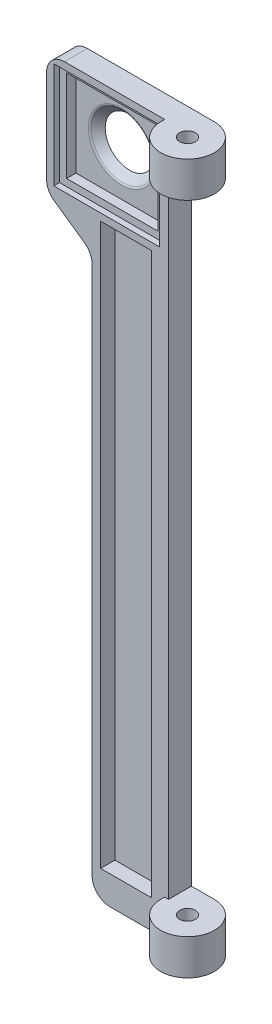
ISO-10303-21;
HEADER;
FILE_DESCRIPTION(('STEP AP214'),'2;1');
FILE_NAME('part.step','',(''),(''),'','','');
FILE_SCHEMA(('AUTOMOTIVE_DESIGN { 1 0 10303 214 1 1 1 1 }'));
ENDSEC;
DATA;
#1=APPLICATION_CONTEXT('core data for automotive mechanical design processes');
#2=APPLICATION_PROTOCOL_DEFINITION('international standard','automotive_design',2000,#1);
#3=PRODUCT_CONTEXT('',#1,'mechanical');
#4=PRODUCT('Part','Part','',(#3));
#5=PRODUCT_RELATED_PRODUCT_CATEGORY('part','',(#4));
#6=PRODUCT_DEFINITION_FORMATION('','',#4);
#7=PRODUCT_DEFINITION_CONTEXT('part definition',#1,'design');
#8=PRODUCT_DEFINITION('design','',#6,#7);
#9=PRODUCT_DEFINITION_SHAPE('','',#8);
#10=(LENGTH_UNIT() NAMED_UNIT(*) SI_UNIT(.MILLI.,.METRE.));
#11=(NAMED_UNIT(*) PLANE_ANGLE_UNIT() SI_UNIT($,.RADIAN.));
#12=(NAMED_UNIT(*) SI_UNIT($,.STERADIAN.) SOLID_ANGLE_UNIT());
#13=UNCERTAINTY_MEASURE_WITH_UNIT(LENGTH_MEASURE(1.E-05),#10,'distance_accuracy_value','');
#14=(GEOMETRIC_REPRESENTATION_CONTEXT(3) GLOBAL_UNCERTAINTY_ASSIGNED_CONTEXT((#13)) GLOBAL_UNIT_ASSIGNED_CONTEXT((#10,
#11,#12)) REPRESENTATION_CONTEXT('',''));
#15=CARTESIAN_POINT('',(0.,0.,0.));
#16=DIRECTION('',(0.,0.,1.));
#17=DIRECTION('',(1.,0.,0.));
#18=AXIS2_PLACEMENT_3D('',#15,#16,#17);
#19=CARTESIAN_POINT('',(0.,0.,4.064));
#20=DIRECTION('',(0.,0.,-1.));
#21=DIRECTION('',(-1.,0.,0.));
#22=AXIS2_PLACEMENT_3D('',#19,#20,#21);
#23=PLANE('',#22);
#24=DIRECTION('',(-1.,0.,0.));
#25=VECTOR('',#24,1.);
#26=CARTESIAN_POINT('',(-6.80720000000004,124.714,4.064));
#27=LINE('',#26,#25);
#28=CARTESIAN_POINT('',(11.9888,124.714,4.064));
#29=VERTEX_POINT('',#28);
#30=CARTESIAN_POINT('',(-6.80720000000004,124.714,4.064));
#31=VERTEX_POINT('',#30);
#32=EDGE_CURVE('E318',#29,#31,#27,.T.);
#33=ORIENTED_EDGE('',*,*,#32,.F.);
#34=DIRECTION('',(0.,1.,0.));
#35=VECTOR('',#34,1.);
#36=CARTESIAN_POINT('',(11.9888,124.714,4.064));
#37=LINE('',#36,#35);
#38=CARTESIAN_POINT('',(11.9888,105.918,4.064));
#39=VERTEX_POINT('',#38);
#40=EDGE_CURVE('E316',#39,#29,#37,.T.);
#41=ORIENTED_EDGE('',*,*,#40,.F.);
#42=DIRECTION('',(1.,0.,0.));
#43=VECTOR('',#42,1.);
#44=CARTESIAN_POINT('',(-6.80720000000004,105.918,4.064));
#45=LINE('',#44,#43);
#46=CARTESIAN_POINT('',(-6.80720000000004,105.918,4.064));
#47=VERTEX_POINT('',#46);
#48=EDGE_CURVE('E306',#47,#39,#45,.T.);
#49=ORIENTED_EDGE('',*,*,#48,.F.);
#50=DIRECTION('',(0.,-1.,0.));
#51=VECTOR('',#50,1.);
#52=CARTESIAN_POINT('',(-6.80720000000004,124.714,4.064));
#53=LINE('',#52,#51);
#54=EDGE_CURVE('E321',#31,#47,#53,.T.);
#55=ORIENTED_EDGE('',*,*,#54,.F.);
#56=EDGE_LOOP('',(#33,#41,#49,#55));
#57=FACE_BOUND('',#56,.T.);
#58=DIRECTION('',(1.,0.,0.));
#59=VECTOR('',#58,1.);
#60=CARTESIAN_POINT('',(15.8749999999999,104.648,4.064));
#61=LINE('',#60,#59);
#62=CARTESIAN_POINT('',(1.524,104.648,4.064));
#63=VERTEX_POINT('',#62);
#64=CARTESIAN_POINT('',(10.5409999999999,104.648,4.064));
#65=VERTEX_POINT('',#64);
#66=EDGE_CURVE('E368',#63,#65,#61,.T.);
#67=ORIENTED_EDGE('',*,*,#66,.T.);
#68=DIRECTION('',(0.,1.,0.));
#69=VECTOR('',#68,1.);
#70=CARTESIAN_POINT('',(10.541,5.08,4.064));
#71=LINE('',#70,#69);
#72=CARTESIAN_POINT('',(10.541,5.08,4.064));
#73=VERTEX_POINT('',#72);
#74=EDGE_CURVE('E397',#73,#65,#71,.T.);
#75=ORIENTED_EDGE('',*,*,#74,.F.);
#76=DIRECTION('',(1.,0.,0.));
#77=VECTOR('',#76,1.);
#78=CARTESIAN_POINT('',(10.541,5.08,4.064));
#79=LINE('',#78,#77);
#80=CARTESIAN_POINT('',(1.52400000000001,5.08,4.064));
#81=VERTEX_POINT('',#80);
#82=EDGE_CURVE('E399',#81,#73,#79,.T.);
#83=ORIENTED_EDGE('',*,*,#82,.F.);
#84=DIRECTION('',(0.,-1.,0.));
#85=VECTOR('',#84,1.);
#86=CARTESIAN_POINT('',(1.524,120.904,4.064));
#87=LINE('',#86,#85);
#88=EDGE_CURVE('E386',#63,#81,#87,.T.);
#89=ORIENTED_EDGE('',*,*,#88,.F.);
#90=EDGE_LOOP('',(#67,#75,#83,#89));
#91=FACE_BOUND('',#90,.T.);
#92=DIRECTION('',(1.,0.,0.));
#93=VECTOR('',#92,1.);
#94=CARTESIAN_POINT('',(0.,0.,4.064));
#95=LINE('',#94,#93);
#96=CARTESIAN_POINT('',(3.175,0.,4.064));
#97=VERTEX_POINT('',#96);
#98=CARTESIAN_POINT('',(12.8905,0.,4.064));
#99=VERTEX_POINT('',#98);
#100=EDGE_CURVE('E54',#97,#99,#95,.T.);
#101=ORIENTED_EDGE('',*,*,#100,.T.);
#102=DIRECTION('',(0.,1.,0.));
#103=VECTOR('',#102,1.);
#104=CARTESIAN_POINT('',(12.8905,-13.4703841816037,4.064));
#105=LINE('',#104,#103);
#106=CARTESIAN_POINT('',(12.8905,6.35000000000004,4.064));
#107=VERTEX_POINT('',#106);
#108=EDGE_CURVE('E49',#99,#107,#105,.T.);
#109=ORIENTED_EDGE('',*,*,#108,.T.);
#110=DIRECTION('',(-1.,0.,0.));
#111=VECTOR('',#110,1.);
#112=CARTESIAN_POINT('',(13.589,6.35000000000004,4.064));
#113=LINE('',#112,#111);
#114=CARTESIAN_POINT('',(13.589,6.35,4.064));
#115=VERTEX_POINT('',#114);
#116=EDGE_CURVE('E257',#115,#107,#113,.T.);
#117=ORIENTED_EDGE('',*,*,#116,.F.);
#118=DIRECTION('',(0.,1.,0.));
#119=VECTOR('',#118,1.);
#120=CARTESIAN_POINT('',(13.589,119.634,4.064));
#121=LINE('',#120,#119);
#122=CARTESIAN_POINT('',(13.589,119.634,4.064));
#123=VERTEX_POINT('',#122);
#124=EDGE_CURVE('E288',#115,#123,#121,.T.);
#125=ORIENTED_EDGE('',*,*,#124,.T.);
#126=DIRECTION('',(1.,0.,0.));
#127=VECTOR('',#126,1.);
#128=CARTESIAN_POINT('',(12.8905,119.634,4.064));
#129=LINE('',#128,#127);
#130=CARTESIAN_POINT('',(12.8905,119.634,4.064));
#131=VERTEX_POINT('',#130);
#132=EDGE_CURVE('E271',#131,#123,#129,.T.);
#133=ORIENTED_EDGE('',*,*,#132,.F.);
#134=DIRECTION('',(0.,1.,0.));
#135=VECTOR('',#134,1.);
#136=CARTESIAN_POINT('',(12.8905,106.163615818396,4.064));
#137=LINE('',#136,#135);
#138=CARTESIAN_POINT('',(12.8905,125.984,4.064));
#139=VERTEX_POINT('',#138);
#140=EDGE_CURVE('E279',#131,#139,#137,.T.);
#141=ORIENTED_EDGE('',*,*,#140,.T.);
#142=DIRECTION('',(-1.,0.,0.));
#143=VECTOR('',#142,1.);
#144=CARTESIAN_POINT('',(0.,125.984,4.064));
#145=LINE('',#144,#143);
#146=CARTESIAN_POINT('',(-4.90220000000005,125.984,4.064));
#147=VERTEX_POINT('',#146);
#148=EDGE_CURVE('E420',#139,#147,#145,.T.);
#149=ORIENTED_EDGE('',*,*,#148,.T.);
#150=CARTESIAN_POINT('',(-4.90220000000005,122.809,4.064));
#151=DIRECTION('',(0.,0.,-1.));
#152=DIRECTION('',(-1.,0.,0.));
#153=AXIS2_PLACEMENT_3D('',#150,#151,#152);
#154=CIRCLE('',#153,3.175);
#155=CARTESIAN_POINT('',(-8.07720000000004,122.809,4.064));
#156=VERTEX_POINT('',#155);
#157=EDGE_CURVE('E464',#147,#156,#154,.F.);
#158=ORIENTED_EDGE('',*,*,#157,.T.);
#159=DIRECTION('',(0.,-1.,0.));
#160=VECTOR('',#159,1.);
#161=CARTESIAN_POINT('',(-8.07720000000004,125.984,4.064));
#162=LINE('',#161,#160);
#163=CARTESIAN_POINT('',(-8.07720000000005,106.265229842561,4.064));
#164=VERTEX_POINT('',#163);
#165=EDGE_CURVE('E365',#156,#164,#162,.T.);
#166=ORIENTED_EDGE('',*,*,#165,.T.);
#167=CARTESIAN_POINT('',(-4.90220000000005,106.265229842561,4.064));
#168=DIRECTION('',(0.,0.,-1.));
#169=DIRECTION('',(-1.,0.,0.));
#170=AXIS2_PLACEMENT_3D('',#167,#168,#169);
#171=CIRCLE('',#170,3.175);
#172=CARTESIAN_POINT('',(-6.72330518541463,103.664422101943,4.064));
#173=VERTEX_POINT('',#172);
#174=EDGE_CURVE('E462',#164,#173,#171,.F.);
#175=ORIENTED_EDGE('',*,*,#174,.T.);
#176=DIRECTION('',(0.819152044288988,-0.573576436351051,0.));
#177=VECTOR('',#176,1.);
#178=CARTESIAN_POINT('',(46.4944465524775,66.4009511684978,4.064));
#179=LINE('',#178,#177);
#180=CARTESIAN_POINT('',(-1.35389481458541,99.9047204845471,4.064));
#181=VERTEX_POINT('',#180);
#182=EDGE_CURVE('E445',#173,#181,#179,.T.);
#183=ORIENTED_EDGE('',*,*,#182,.T.);
#184=CARTESIAN_POINT('',(-3.175,97.3039127439296,4.064));
#185=DIRECTION('',(0.,0.,-1.));
#186=DIRECTION('',(-1.,0.,0.));
#187=AXIS2_PLACEMENT_3D('',#184,#185,#186);
#188=CIRCLE('',#187,3.175);
#189=CARTESIAN_POINT('',(0.,97.3039127439296,4.064));
#190=VERTEX_POINT('',#189);
#191=EDGE_CURVE('E483',#181,#190,#188,.T.);
#192=ORIENTED_EDGE('',*,*,#191,.T.);
#193=DIRECTION('',(0.,-1.,0.));
#194=VECTOR('',#193,1.);
#195=CARTESIAN_POINT('',(0.,0.,4.064));
#196=LINE('',#195,#194);
#197=CARTESIAN_POINT('',(0.,3.175,4.064));
#198=VERTEX_POINT('',#197);
#199=EDGE_CURVE('E415',#190,#198,#196,.T.);
#200=ORIENTED_EDGE('',*,*,#199,.T.);
#201=CARTESIAN_POINT('',(3.175,3.175,4.064));
#202=DIRECTION('',(0.,0.,-1.));
#203=DIRECTION('',(-1.,0.,0.));
#204=AXIS2_PLACEMENT_3D('',#201,#202,#203);
#205=CIRCLE('',#204,3.175);
#206=EDGE_CURVE('E466',#198,#97,#205,.F.);
#207=ORIENTED_EDGE('',*,*,#206,.T.);
#208=EDGE_LOOP('',(#101,#109,#117,#125,#133,#141,#149,#158,#166,#175,#183,#192,#200,#207));
#209=FACE_BOUND('',#208,.T.);
#210=ADVANCED_FACE('F33',(#57,#91,#209),#23,.F.);
#211=CARTESIAN_POINT('',(0.,0.,0.));
#212=DIRECTION('',(0.,0.,-1.));
#213=DIRECTION('',(-1.,0.,0.));
#214=AXIS2_PLACEMENT_3D('',#211,#212,#213);
#215=PLANE('',#214);
#216=DIRECTION('',(0.,1.,0.));
#217=VECTOR('',#216,1.);
#218=CARTESIAN_POINT('',(13.589,119.634,0.));
#219=LINE('',#218,#217);
#220=CARTESIAN_POINT('',(13.589,6.35,0.));
#221=VERTEX_POINT('',#220);
#222=CARTESIAN_POINT('',(13.589,119.634,0.));
#223=VERTEX_POINT('',#222);
#224=EDGE_CURVE('E294',#221,#223,#219,.T.);
#225=ORIENTED_EDGE('',*,*,#224,.F.);
#226=DIRECTION('',(-1.,0.,0.));
#227=VECTOR('',#226,1.);
#228=CARTESIAN_POINT('',(15.875,6.34999999999999,0.));
#229=LINE('',#228,#227);
#230=CARTESIAN_POINT('',(17.653,6.35000000000004,0.));
#231=VERTEX_POINT('',#230);
#232=EDGE_CURVE('E287',#231,#221,#229,.T.);
#233=ORIENTED_EDGE('',*,*,#232,.F.);
#234=DIRECTION('',(0.,1.,0.));
#235=VECTOR('',#234,1.);
#236=CARTESIAN_POINT('',(17.653,-13.4703841816037,0.));
#237=LINE('',#236,#235);
#238=CARTESIAN_POINT('',(17.653,0.,0.));
#239=VERTEX_POINT('',#238);
#240=EDGE_CURVE('E245',#239,#231,#237,.T.);
#241=ORIENTED_EDGE('',*,*,#240,.F.);
#242=DIRECTION('',(1.,0.,0.));
#243=VECTOR('',#242,1.);
#244=CARTESIAN_POINT('',(0.,0.,0.));
#245=LINE('',#244,#243);
#246=CARTESIAN_POINT('',(3.175,0.,0.));
#247=VERTEX_POINT('',#246);
#248=EDGE_CURVE('E425',#247,#239,#245,.T.);
#249=ORIENTED_EDGE('',*,*,#248,.F.);
#250=CARTESIAN_POINT('',(3.175,3.175,0.));
#251=DIRECTION('',(0.,0.,-1.));
#252=DIRECTION('',(-1.,0.,0.));
#253=AXIS2_PLACEMENT_3D('',#250,#251,#252);
#254=CIRCLE('',#253,3.175);
#255=CARTESIAN_POINT('',(0.,3.175,0.));
#256=VERTEX_POINT('',#255);
#257=EDGE_CURVE('E455',#247,#256,#254,.T.);
#258=ORIENTED_EDGE('',*,*,#257,.T.);
#259=DIRECTION('',(0.,-1.,0.));
#260=VECTOR('',#259,1.);
#261=CARTESIAN_POINT('',(0.,0.,0.));
#262=LINE('',#261,#260);
#263=CARTESIAN_POINT('',(0.,97.3039127439296,0.));
#264=VERTEX_POINT('',#263);
#265=EDGE_CURVE('E414',#264,#256,#262,.T.);
#266=ORIENTED_EDGE('',*,*,#265,.F.);
#267=CARTESIAN_POINT('',(-3.175,97.3039127439296,0.));
#268=DIRECTION('',(0.,0.,-1.));
#269=DIRECTION('',(-1.,0.,0.));
#270=AXIS2_PLACEMENT_3D('',#267,#268,#269);
#271=CIRCLE('',#270,3.175);
#272=CARTESIAN_POINT('',(-1.35389481458541,99.9047204845471,0.));
#273=VERTEX_POINT('',#272);
#274=EDGE_CURVE('E481',#264,#273,#271,.F.);
#275=ORIENTED_EDGE('',*,*,#274,.T.);
#276=DIRECTION('',(-0.819152044288988,0.573576436351051,0.));
#277=VECTOR('',#276,1.);
#278=CARTESIAN_POINT('',(0.,98.9567131294314,0.));
#279=LINE('',#278,#277);
#280=CARTESIAN_POINT('',(-6.72330518541463,103.664422101943,0.));
#281=VERTEX_POINT('',#280);
#282=EDGE_CURVE('E440',#273,#281,#279,.T.);
#283=ORIENTED_EDGE('',*,*,#282,.T.);
#284=CARTESIAN_POINT('',(-4.90220000000005,106.265229842561,0.));
#285=DIRECTION('',(0.,0.,-1.));
#286=DIRECTION('',(-1.,0.,0.));
#287=AXIS2_PLACEMENT_3D('',#284,#285,#286);
#288=CIRCLE('',#287,3.175);
#289=CARTESIAN_POINT('',(-8.07720000000005,106.265229842561,0.));
#290=VERTEX_POINT('',#289);
#291=EDGE_CURVE('E451',#281,#290,#288,.T.);
#292=ORIENTED_EDGE('',*,*,#291,.T.);
#293=DIRECTION('',(0.,1.,0.));
#294=VECTOR('',#293,1.);
#295=CARTESIAN_POINT('',(-8.07720000000004,125.984,0.));
#296=LINE('',#295,#294);
#297=CARTESIAN_POINT('',(-8.07720000000004,122.809,0.));
#298=VERTEX_POINT('',#297);
#299=EDGE_CURVE('E369',#290,#298,#296,.T.);
#300=ORIENTED_EDGE('',*,*,#299,.T.);
#301=CARTESIAN_POINT('',(-4.90220000000005,122.809,0.));
#302=DIRECTION('',(0.,0.,-1.));
#303=DIRECTION('',(-1.,0.,0.));
#304=AXIS2_PLACEMENT_3D('',#301,#302,#303);
#305=CIRCLE('',#304,3.175);
#306=CARTESIAN_POINT('',(-4.90220000000005,125.984,0.));
#307=VERTEX_POINT('',#306);
#308=EDGE_CURVE('E453',#298,#307,#305,.T.);
#309=ORIENTED_EDGE('',*,*,#308,.T.);
#310=DIRECTION('',(-1.,0.,0.));
#311=VECTOR('',#310,1.);
#312=CARTESIAN_POINT('',(0.,125.984,0.));
#313=LINE('',#312,#311);
#314=CARTESIAN_POINT('',(17.653,125.984,0.));
#315=VERTEX_POINT('',#314);
#316=EDGE_CURVE('E418',#315,#307,#313,.T.);
#317=ORIENTED_EDGE('',*,*,#316,.F.);
#318=DIRECTION('',(0.,1.,0.));
#319=VECTOR('',#318,1.);
#320=CARTESIAN_POINT('',(17.653,106.163615818396,0.));
#321=LINE('',#320,#319);
#322=CARTESIAN_POINT('',(17.653,119.634,0.));
#323=VERTEX_POINT('',#322);
#324=EDGE_CURVE('E269',#323,#315,#321,.T.);
#325=ORIENTED_EDGE('',*,*,#324,.F.);
#326=DIRECTION('',(1.,0.,0.));
#327=VECTOR('',#326,1.);
#328=CARTESIAN_POINT('',(15.875,119.634,0.));
#329=LINE('',#328,#327);
#330=EDGE_CURVE('E292',#223,#323,#329,.T.);
#331=ORIENTED_EDGE('',*,*,#330,.F.);
#332=EDGE_LOOP('',(#225,#233,#241,#249,#258,#266,#275,#283,#292,#300,#309,#317,#325,#331));
#333=FACE_BOUND('',#332,.T.);
#334=CARTESIAN_POINT('',(2.59079999999995,115.316,0.));
#335=DIRECTION('',(0.,0.,-1.));
#336=DIRECTION('',(-1.,0.,0.));
#337=AXIS2_PLACEMENT_3D('',#334,#335,#336);
#338=CIRCLE('',#337,4.318);
#339=CARTESIAN_POINT('',(-1.72720000000005,115.316,0.));
#340=VERTEX_POINT('',#339);
#341=EDGE_CURVE('E300',#340,#340,#338,.T.);
#342=ORIENTED_EDGE('',*,*,#341,.F.);
#343=EDGE_LOOP('',(#342));
#344=FACE_BOUND('',#343,.T.);
#345=DIRECTION('',(0.,1.,0.));
#346=VECTOR('',#345,1.);
#347=CARTESIAN_POINT('',(10.541,5.08,0.));
#348=LINE('',#347,#346);
#349=CARTESIAN_POINT('',(10.541,5.08,0.));
#350=VERTEX_POINT('',#349);
#351=CARTESIAN_POINT('',(10.5409999999999,104.648,0.));
#352=VERTEX_POINT('',#351);
#353=EDGE_CURVE('E396',#350,#352,#348,.T.);
#354=ORIENTED_EDGE('',*,*,#353,.T.);
#355=DIRECTION('',(-1.,0.,0.));
#356=VECTOR('',#355,1.);
#357=CARTESIAN_POINT('',(15.8749999999999,104.648,0.));
#358=LINE('',#357,#356);
#359=CARTESIAN_POINT('',(8.636,104.648,0.));
#360=VERTEX_POINT('',#359);
#361=EDGE_CURVE('E356',#352,#360,#358,.T.);
#362=ORIENTED_EDGE('',*,*,#361,.T.);
#363=DIRECTION('',(0.,-1.,0.));
#364=VECTOR('',#363,1.);
#365=CARTESIAN_POINT('',(8.636,5.08,0.));
#366=LINE('',#365,#364);
#367=CARTESIAN_POINT('',(8.636,5.08,0.));
#368=VERTEX_POINT('',#367);
#369=EDGE_CURVE('E405',#360,#368,#366,.T.);
#370=ORIENTED_EDGE('',*,*,#369,.T.);
#371=DIRECTION('',(1.,0.,0.));
#372=VECTOR('',#371,1.);
#373=CARTESIAN_POINT('',(10.541,5.08,0.));
#374=LINE('',#373,#372);
#375=EDGE_CURVE('E400',#368,#350,#374,.T.);
#376=ORIENTED_EDGE('',*,*,#375,.T.);
#377=EDGE_LOOP('',(#354,#362,#370,#376));
#378=FACE_BOUND('',#377,.T.);
#379=ADVANCED_FACE('F506',(#333,#344,#378),#215,.T.);
#380=CARTESIAN_POINT('',(0.,0.,4.064));
#381=DIRECTION('',(1.,0.,0.));
#382=DIRECTION('',(0.,0.,-1.));
#383=AXIS2_PLACEMENT_3D('',#380,#381,#382);
#384=PLANE('',#383);
#385=ORIENTED_EDGE('',*,*,#265,.T.);
#386=DIRECTION('',(0.,0.,-1.));
#387=VECTOR('',#386,1.);
#388=CARTESIAN_POINT('',(0.,3.175,4.064));
#389=LINE('',#388,#387);
#390=EDGE_CURVE('E460',#256,#198,#389,.F.);
#391=ORIENTED_EDGE('',*,*,#390,.T.);
#392=ORIENTED_EDGE('',*,*,#199,.F.);
#393=DIRECTION('',(0.,0.,-1.));
#394=VECTOR('',#393,1.);
#395=CARTESIAN_POINT('',(0.,97.3039127439296,0.));
#396=LINE('',#395,#394);
#397=EDGE_CURVE('E457',#190,#264,#396,.T.);
#398=ORIENTED_EDGE('',*,*,#397,.T.);
#399=EDGE_LOOP('',(#385,#391,#392,#398));
#400=FACE_BOUND('',#399,.T.);
#401=ADVANCED_FACE('F512',(#400),#384,.F.);
#402=CARTESIAN_POINT('',(0.,0.,4.064));
#403=DIRECTION('',(0.,1.,0.));
#404=DIRECTION('',(-1.,0.,0.));
#405=AXIS2_PLACEMENT_3D('',#402,#403,#404);
#406=PLANE('',#405);
#407=CARTESIAN_POINT('',(17.653,0.,4.7625));
#408=DIRECTION('',(0.,1.,0.));
#409=DIRECTION('',(0.,0.,1.));
#410=AXIS2_PLACEMENT_3D('',#407,#408,#409);
#411=CIRCLE('',#410,1.397);
#412=CARTESIAN_POINT('',(17.653,0.,6.1595));
#413=VERTEX_POINT('',#412);
#414=EDGE_CURVE('E592',#413,#413,#411,.T.);
#415=ORIENTED_EDGE('',*,*,#414,.T.);
#416=EDGE_LOOP('',(#415));
#417=FACE_BOUND('',#416,.T.);
#418=ORIENTED_EDGE('',*,*,#248,.T.);
#419=CARTESIAN_POINT('',(17.653,0.,4.7625));
#420=DIRECTION('',(0.,1.,0.));
#421=DIRECTION('',(-1.,0.,0.));
#422=AXIS2_PLACEMENT_3D('',#419,#420,#421);
#423=CIRCLE('',#422,4.7625);
#424=CARTESIAN_POINT('',(12.8905,0.,4.7625));
#425=VERTEX_POINT('',#424);
#426=EDGE_CURVE('E276',#239,#425,#423,.F.);
#427=ORIENTED_EDGE('',*,*,#426,.T.);
#428=DIRECTION('',(0.,0.,-1.));
#429=VECTOR('',#428,1.);
#430=CARTESIAN_POINT('',(12.8905,0.,4.064));
#431=LINE('',#430,#429);
#432=EDGE_CURVE('E242',#425,#99,#431,.T.);
#433=ORIENTED_EDGE('',*,*,#432,.T.);
#434=ORIENTED_EDGE('',*,*,#100,.F.);
#435=DIRECTION('',(0.,0.,-1.));
#436=VECTOR('',#435,1.);
#437=CARTESIAN_POINT('',(3.175,0.,4.064));
#438=LINE('',#437,#436);
#439=EDGE_CURVE('E448',#97,#247,#438,.T.);
#440=ORIENTED_EDGE('',*,*,#439,.T.);
#441=EDGE_LOOP('',(#418,#427,#433,#434,#440));
#442=FACE_BOUND('',#441,.T.);
#443=ADVANCED_FACE('F524',(#417,#442),#406,.F.);
#444=CARTESIAN_POINT('',(0.,125.984,4.064));
#445=DIRECTION('',(0.,-1.,0.));
#446=DIRECTION('',(0.,0.,-1.));
#447=AXIS2_PLACEMENT_3D('',#444,#445,#446);
#448=PLANE('',#447);
#449=CARTESIAN_POINT('',(17.653,125.984,4.7625));
#450=DIRECTION('',(0.,1.,0.));
#451=DIRECTION('',(0.,0.,1.));
#452=AXIS2_PLACEMENT_3D('',#449,#450,#451);
#453=CIRCLE('',#452,1.397);
#454=CARTESIAN_POINT('',(17.653,125.984,6.1595));
#455=VERTEX_POINT('',#454);
#456=EDGE_CURVE('E589',#455,#455,#453,.T.);
#457=ORIENTED_EDGE('',*,*,#456,.F.);
#458=EDGE_LOOP('',(#457));
#459=FACE_BOUND('',#458,.T.);
#460=CARTESIAN_POINT('',(17.653,125.984,4.7625));
#461=DIRECTION('',(0.,1.,0.));
#462=DIRECTION('',(0.,0.,-1.));
#463=AXIS2_PLACEMENT_3D('',#460,#461,#462);
#464=CIRCLE('',#463,4.7625);
#465=CARTESIAN_POINT('',(12.8905,125.984,4.7625));
#466=VERTEX_POINT('',#465);
#467=EDGE_CURVE('E275',#466,#315,#464,.T.);
#468=ORIENTED_EDGE('',*,*,#467,.T.);
#469=ORIENTED_EDGE('',*,*,#316,.T.);
#470=DIRECTION('',(0.,0.,-1.));
#471=VECTOR('',#470,1.);
#472=CARTESIAN_POINT('',(-4.90220000000005,125.984,4.064));
#473=LINE('',#472,#471);
#474=EDGE_CURVE('E474',#307,#147,#473,.F.);
#475=ORIENTED_EDGE('',*,*,#474,.T.);
#476=ORIENTED_EDGE('',*,*,#148,.F.);
#477=DIRECTION('',(0.,0.,1.));
#478=VECTOR('',#477,1.);
#479=CARTESIAN_POINT('',(12.8905,125.984,4.7625));
#480=LINE('',#479,#478);
#481=EDGE_CURVE('E272',#139,#466,#480,.T.);
#482=ORIENTED_EDGE('',*,*,#481,.T.);
#483=EDGE_LOOP('',(#468,#469,#475,#476,#482));
#484=FACE_BOUND('',#483,.T.);
#485=ADVANCED_FACE('F521',(#459,#484),#448,.F.);
#486=CARTESIAN_POINT('',(10.541,5.08,4.064));
#487=DIRECTION('',(-1.,0.,0.));
#488=DIRECTION('',(0.,-1.,0.));
#489=AXIS2_PLACEMENT_3D('',#486,#487,#488);
#490=PLANE('',#489);
#491=DIRECTION('',(0.,0.,1.));
#492=VECTOR('',#491,1.);
#493=CARTESIAN_POINT('',(10.5409999999999,104.648,4.064));
#494=LINE('',#493,#492);
#495=EDGE_CURVE('E383',#352,#65,#494,.T.);
#496=ORIENTED_EDGE('',*,*,#495,.F.);
#497=ORIENTED_EDGE('',*,*,#353,.F.);
#498=DIRECTION('',(0.,0.,-1.));
#499=VECTOR('',#498,1.);
#500=CARTESIAN_POINT('',(10.541,5.08,4.064));
#501=LINE('',#500,#499);
#502=EDGE_CURVE('E402',#73,#350,#501,.T.);
#503=ORIENTED_EDGE('',*,*,#502,.F.);
#504=ORIENTED_EDGE('',*,*,#74,.T.);
#505=EDGE_LOOP('',(#496,#497,#503,#504));
#506=FACE_BOUND('',#505,.T.);
#507=ADVANCED_FACE('F518',(#506),#490,.T.);
#508=CARTESIAN_POINT('',(8.636,5.08,4.064));
#509=DIRECTION('',(1.,0.,0.));
#510=DIRECTION('',(0.,0.,-1.));
#511=AXIS2_PLACEMENT_3D('',#508,#509,#510);
#512=PLANE('',#511);
#513=DIRECTION('',(0.,0.,-1.));
#514=VECTOR('',#513,1.);
#515=CARTESIAN_POINT('',(8.636,104.648,4.064));
#516=LINE('',#515,#514);
#517=CARTESIAN_POINT('',(8.636,104.648,1.016));
#518=VERTEX_POINT('',#517);
#519=EDGE_CURVE('E380',#518,#360,#516,.T.);
#520=ORIENTED_EDGE('',*,*,#519,.F.);
#521=DIRECTION('',(0.,1.,0.));
#522=VECTOR('',#521,1.);
#523=CARTESIAN_POINT('',(8.636,5.08,1.016));
#524=LINE('',#523,#522);
#525=CARTESIAN_POINT('',(8.636,5.08,1.016));
#526=VERTEX_POINT('',#525);
#527=EDGE_CURVE('E431',#518,#526,#524,.F.);
#528=ORIENTED_EDGE('',*,*,#527,.T.);
#529=DIRECTION('',(0.,0.,-1.));
#530=VECTOR('',#529,1.);
#531=CARTESIAN_POINT('',(8.636,5.08,4.064));
#532=LINE('',#531,#530);
#533=EDGE_CURVE('E411',#526,#368,#532,.T.);
#534=ORIENTED_EDGE('',*,*,#533,.T.);
#535=ORIENTED_EDGE('',*,*,#369,.F.);
#536=EDGE_LOOP('',(#520,#528,#534,#535));
#537=FACE_BOUND('',#536,.T.);
#538=ADVANCED_FACE('F679',(#537),#512,.T.);
#539=CARTESIAN_POINT('',(10.541,5.08,4.064));
#540=DIRECTION('',(0.,1.,0.));
#541=DIRECTION('',(-1.,0.,0.));
#542=AXIS2_PLACEMENT_3D('',#539,#540,#541);
#543=PLANE('',#542);
#544=ORIENTED_EDGE('',*,*,#375,.F.);
#545=ORIENTED_EDGE('',*,*,#533,.F.);
#546=CARTESIAN_POINT('',(8.128,5.08,1.016));
#547=DIRECTION('',(0.,1.,0.));
#548=DIRECTION('',(-1.,0.,0.));
#549=AXIS2_PLACEMENT_3D('',#546,#547,#548);
#550=CIRCLE('',#549,0.508);
#551=CARTESIAN_POINT('',(8.128,5.08,1.524));
#552=VERTEX_POINT('',#551);
#553=EDGE_CURVE('E433',#526,#552,#550,.F.);
#554=ORIENTED_EDGE('',*,*,#553,.T.);
#555=DIRECTION('',(1.,0.,0.));
#556=VECTOR('',#555,1.);
#557=CARTESIAN_POINT('',(8.63600000000001,5.08,1.524));
#558=LINE('',#557,#556);
#559=CARTESIAN_POINT('',(1.52400000000001,5.08,1.524));
#560=VERTEX_POINT('',#559);
#561=EDGE_CURVE('E389',#560,#552,#558,.T.);
#562=ORIENTED_EDGE('',*,*,#561,.F.);
#563=DIRECTION('',(0.,0.,1.));
#564=VECTOR('',#563,1.);
#565=CARTESIAN_POINT('',(1.52400000000001,5.08,1.524));
#566=LINE('',#565,#564);
#567=EDGE_CURVE('E392',#560,#81,#566,.T.);
#568=ORIENTED_EDGE('',*,*,#567,.T.);
#569=ORIENTED_EDGE('',*,*,#82,.T.);
#570=ORIENTED_EDGE('',*,*,#502,.T.);
#571=EDGE_LOOP('',(#544,#545,#554,#562,#568,#569,#570));
#572=FACE_BOUND('',#571,.T.);
#573=ADVANCED_FACE('F676',(#572),#543,.T.);
#574=CARTESIAN_POINT('',(1.524,120.904,1.524));
#575=DIRECTION('',(-1.,0.,0.));
#576=DIRECTION('',(0.,-1.,0.));
#577=AXIS2_PLACEMENT_3D('',#574,#575,#576);
#578=PLANE('',#577);
#579=DIRECTION('',(0.,-1.,0.));
#580=VECTOR('',#579,1.);
#581=CARTESIAN_POINT('',(1.524,120.904,1.524));
#582=LINE('',#581,#580);
#583=CARTESIAN_POINT('',(1.524,104.648,1.524));
#584=VERTEX_POINT('',#583);
#585=EDGE_CURVE('E387',#584,#560,#582,.T.);
#586=ORIENTED_EDGE('',*,*,#585,.F.);
#587=DIRECTION('',(0.,0.,1.));
#588=VECTOR('',#587,1.);
#589=CARTESIAN_POINT('',(1.524,104.648,1.524));
#590=LINE('',#589,#588);
#591=EDGE_CURVE('E378',#584,#63,#590,.T.);
#592=ORIENTED_EDGE('',*,*,#591,.T.);
#593=ORIENTED_EDGE('',*,*,#88,.T.);
#594=ORIENTED_EDGE('',*,*,#567,.F.);
#595=EDGE_LOOP('',(#586,#592,#593,#594));
#596=FACE_BOUND('',#595,.T.);
#597=ADVANCED_FACE('F672',(#596),#578,.F.);
#598=CARTESIAN_POINT('',(0.,0.,1.524));
#599=DIRECTION('',(0.,0.,-1.));
#600=DIRECTION('',(-1.,0.,0.));
#601=AXIS2_PLACEMENT_3D('',#598,#599,#600);
#602=PLANE('',#601);
#603=DIRECTION('',(0.,1.,0.));
#604=VECTOR('',#603,1.);
#605=CARTESIAN_POINT('',(8.128,120.904,1.524));
#606=LINE('',#605,#604);
#607=CARTESIAN_POINT('',(8.128,104.648,1.524));
#608=VERTEX_POINT('',#607);
#609=EDGE_CURVE('E422',#552,#608,#606,.T.);
#610=ORIENTED_EDGE('',*,*,#609,.T.);
#611=DIRECTION('',(-1.,0.,0.));
#612=VECTOR('',#611,1.);
#613=CARTESIAN_POINT('',(0.,104.648,1.524));
#614=LINE('',#613,#612);
#615=EDGE_CURVE('E376',#608,#584,#614,.T.);
#616=ORIENTED_EDGE('',*,*,#615,.T.);
#617=ORIENTED_EDGE('',*,*,#585,.T.);
#618=ORIENTED_EDGE('',*,*,#561,.T.);
#619=EDGE_LOOP('',(#610,#616,#617,#618));
#620=FACE_BOUND('',#619,.T.);
#621=ADVANCED_FACE('F536',(#620),#602,.F.);
#622=CARTESIAN_POINT('',(8.128,0.,1.016));
#623=DIRECTION('',(0.,-1.,0.));
#624=DIRECTION('',(0.,0.,-1.));
#625=AXIS2_PLACEMENT_3D('',#622,#623,#624);
#626=CYLINDRICAL_SURFACE('',#625,0.508);
#627=CARTESIAN_POINT('',(8.128,104.648,1.016));
#628=DIRECTION('',(0.,-1.,0.));
#629=DIRECTION('',(0.,0.,-1.));
#630=AXIS2_PLACEMENT_3D('',#627,#628,#629);
#631=CIRCLE('',#630,0.508);
#632=EDGE_CURVE('E435',#608,#518,#631,.F.);
#633=ORIENTED_EDGE('',*,*,#632,.F.);
#634=ORIENTED_EDGE('',*,*,#609,.F.);
#635=ORIENTED_EDGE('',*,*,#553,.F.);
#636=ORIENTED_EDGE('',*,*,#527,.F.);
#637=EDGE_LOOP('',(#633,#634,#635,#636));
#638=FACE_BOUND('',#637,.T.);
#639=ADVANCED_FACE('F532',(#638),#626,.T.);
#640=CARTESIAN_POINT('',(15.8749999999999,104.648,36.1409821030595));
#641=DIRECTION('',(0.,-1.,0.));
#642=DIRECTION('',(0.,0.,-1.));
#643=AXIS2_PLACEMENT_3D('',#640,#641,#642);
#644=PLANE('',#643);
#645=ORIENTED_EDGE('',*,*,#361,.F.);
#646=ORIENTED_EDGE('',*,*,#495,.T.);
#647=ORIENTED_EDGE('',*,*,#66,.F.);
#648=ORIENTED_EDGE('',*,*,#591,.F.);
#649=ORIENTED_EDGE('',*,*,#615,.F.);
#650=ORIENTED_EDGE('',*,*,#632,.T.);
#651=ORIENTED_EDGE('',*,*,#519,.T.);
#652=EDGE_LOOP('',(#645,#646,#647,#648,#649,#650,#651));
#653=FACE_BOUND('',#652,.T.);
#654=ADVANCED_FACE('F535',(#653),#644,.T.);
#655=CARTESIAN_POINT('',(-8.07720000000004,125.984,36.1409821030595));
#656=DIRECTION('',(-1.,0.,0.));
#657=DIRECTION('',(0.,-1.,0.));
#658=AXIS2_PLACEMENT_3D('',#655,#656,#657);
#659=PLANE('',#658);
#660=ORIENTED_EDGE('',*,*,#165,.F.);
#661=DIRECTION('',(0.,0.,-1.));
#662=VECTOR('',#661,1.);
#663=CARTESIAN_POINT('',(-8.07720000000004,122.809,0.));
#664=LINE('',#663,#662);
#665=EDGE_CURVE('E471',#156,#298,#664,.T.);
#666=ORIENTED_EDGE('',*,*,#665,.T.);
#667=ORIENTED_EDGE('',*,*,#299,.F.);
#668=DIRECTION('',(0.,0.,1.));
#669=VECTOR('',#668,1.);
#670=CARTESIAN_POINT('',(-8.07720000000005,106.265229842561,4.064));
#671=LINE('',#670,#669);
#672=EDGE_CURVE('E468',#290,#164,#671,.T.);
#673=ORIENTED_EDGE('',*,*,#672,.T.);
#674=EDGE_LOOP('',(#660,#666,#667,#673));
#675=FACE_BOUND('',#674,.T.);
#676=ADVANCED_FACE('F563',(#675),#659,.T.);
#677=CARTESIAN_POINT('',(0.,0.,3.048));
#678=DIRECTION('',(0.,0.,1.));
#679=DIRECTION('',(1.,0.,0.));
#680=AXIS2_PLACEMENT_3D('',#677,#678,#679);
#681=PLANE('',#680);
#682=DIRECTION('',(0.,1.,0.));
#683=VECTOR('',#682,1.);
#684=CARTESIAN_POINT('',(11.9888,124.714,3.048));
#685=LINE('',#684,#683);
#686=CARTESIAN_POINT('',(11.9888,105.918,3.048));
#687=VERTEX_POINT('',#686);
#688=CARTESIAN_POINT('',(11.9888,124.714,3.048));
#689=VERTEX_POINT('',#688);
#690=EDGE_CURVE('E302',#687,#689,#685,.T.);
#691=ORIENTED_EDGE('',*,*,#690,.T.);
#692=DIRECTION('',(-1.,0.,0.));
#693=VECTOR('',#692,1.);
#694=CARTESIAN_POINT('',(-6.80720000000004,124.714,3.048));
#695=LINE('',#694,#693);
#696=CARTESIAN_POINT('',(-6.80720000000004,124.714,3.048));
#697=VERTEX_POINT('',#696);
#698=EDGE_CURVE('E305',#689,#697,#695,.T.);
#699=ORIENTED_EDGE('',*,*,#698,.T.);
#700=DIRECTION('',(0.,-1.,0.));
#701=VECTOR('',#700,1.);
#702=CARTESIAN_POINT('',(-6.80720000000004,124.714,3.048));
#703=LINE('',#702,#701);
#704=CARTESIAN_POINT('',(-6.80720000000004,105.918,3.048));
#705=VERTEX_POINT('',#704);
#706=EDGE_CURVE('E309',#697,#705,#703,.T.);
#707=ORIENTED_EDGE('',*,*,#706,.T.);
#708=DIRECTION('',(1.,0.,0.));
#709=VECTOR('',#708,1.);
#710=CARTESIAN_POINT('',(-6.80720000000004,105.918,3.048));
#711=LINE('',#710,#709);
#712=EDGE_CURVE('E312',#705,#687,#711,.T.);
#713=ORIENTED_EDGE('',*,*,#712,.T.);
#714=EDGE_LOOP('',(#691,#699,#707,#713));
#715=FACE_BOUND('',#714,.T.);
#716=DIRECTION('',(0.,1.,0.));
#717=VECTOR('',#716,1.);
#718=CARTESIAN_POINT('',(-5.53720000000005,123.444,3.048));
#719=LINE('',#718,#717);
#720=CARTESIAN_POINT('',(-5.53720000000005,107.188,3.048));
#721=VERTEX_POINT('',#720);
#722=CARTESIAN_POINT('',(-5.53720000000005,123.444,3.048));
#723=VERTEX_POINT('',#722);
#724=EDGE_CURVE('E340',#721,#723,#719,.T.);
#725=ORIENTED_EDGE('',*,*,#724,.T.);
#726=DIRECTION('',(-1.,0.,0.));
#727=VECTOR('',#726,1.);
#728=CARTESIAN_POINT('',(-5.53720000000005,123.444,3.048));
#729=LINE('',#728,#727);
#730=CARTESIAN_POINT('',(10.7188,123.444,3.048));
#731=VERTEX_POINT('',#730);
#732=EDGE_CURVE('E337',#731,#723,#729,.T.);
#733=ORIENTED_EDGE('',*,*,#732,.F.);
#734=DIRECTION('',(0.,1.,0.));
#735=VECTOR('',#734,1.);
#736=CARTESIAN_POINT('',(10.7188,123.444,3.048));
#737=LINE('',#736,#735);
#738=CARTESIAN_POINT('',(10.7188,107.188,3.048));
#739=VERTEX_POINT('',#738);
#740=EDGE_CURVE('E328',#739,#731,#737,.T.);
#741=ORIENTED_EDGE('',*,*,#740,.F.);
#742=DIRECTION('',(-1.,0.,0.));
#743=VECTOR('',#742,1.);
#744=CARTESIAN_POINT('',(-5.53720000000005,107.188,3.048));
#745=LINE('',#744,#743);
#746=EDGE_CURVE('E438',#739,#721,#745,.T.);
#747=ORIENTED_EDGE('',*,*,#746,.T.);
#748=EDGE_LOOP('',(#725,#733,#741,#747));
#749=FACE_BOUND('',#748,.T.);
#750=ADVANCED_FACE('F626',(#715,#749),#681,.T.);
#751=CARTESIAN_POINT('',(11.9888,124.714,3.048));
#752=DIRECTION('',(1.,0.,0.));
#753=DIRECTION('',(0.,0.,-1.));
#754=AXIS2_PLACEMENT_3D('',#751,#752,#753);
#755=PLANE('',#754);
#756=ORIENTED_EDGE('',*,*,#40,.T.);
#757=DIRECTION('',(0.,0.,1.));
#758=VECTOR('',#757,1.);
#759=CARTESIAN_POINT('',(11.9888,124.714,3.048));
#760=LINE('',#759,#758);
#761=EDGE_CURVE('E315',#689,#29,#760,.T.);
#762=ORIENTED_EDGE('',*,*,#761,.F.);
#763=ORIENTED_EDGE('',*,*,#690,.F.);
#764=DIRECTION('',(0.,0.,1.));
#765=VECTOR('',#764,1.);
#766=CARTESIAN_POINT('',(11.9888,105.918,3.048));
#767=LINE('',#766,#765);
#768=EDGE_CURVE('E326',#687,#39,#767,.T.);
#769=ORIENTED_EDGE('',*,*,#768,.T.);
#770=EDGE_LOOP('',(#756,#762,#763,#769));
#771=FACE_BOUND('',#770,.T.);
#772=ADVANCED_FACE('F629',(#771),#755,.F.);
#773=CARTESIAN_POINT('',(-6.80720000000004,105.918,3.048));
#774=DIRECTION('',(0.,-1.,0.));
#775=DIRECTION('',(0.,0.,-1.));
#776=AXIS2_PLACEMENT_3D('',#773,#774,#775);
#777=PLANE('',#776);
#778=ORIENTED_EDGE('',*,*,#48,.T.);
#779=ORIENTED_EDGE('',*,*,#768,.F.);
#780=ORIENTED_EDGE('',*,*,#712,.F.);
#781=DIRECTION('',(0.,0.,1.));
#782=VECTOR('',#781,1.);
#783=CARTESIAN_POINT('',(-6.80720000000004,105.918,3.048));
#784=LINE('',#783,#782);
#785=EDGE_CURVE('E329',#705,#47,#784,.T.);
#786=ORIENTED_EDGE('',*,*,#785,.T.);
#787=EDGE_LOOP('',(#778,#779,#780,#786));
#788=FACE_BOUND('',#787,.T.);
#789=ADVANCED_FACE('F631',(#788),#777,.F.);
#790=CARTESIAN_POINT('',(-6.80720000000004,124.714,3.048));
#791=DIRECTION('',(-1.,0.,0.));
#792=DIRECTION('',(0.,-1.,0.));
#793=AXIS2_PLACEMENT_3D('',#790,#791,#792);
#794=PLANE('',#793);
#795=ORIENTED_EDGE('',*,*,#54,.T.);
#796=ORIENTED_EDGE('',*,*,#785,.F.);
#797=ORIENTED_EDGE('',*,*,#706,.F.);
#798=DIRECTION('',(0.,0.,1.));
#799=VECTOR('',#798,1.);
#800=CARTESIAN_POINT('',(-6.80720000000004,124.714,3.048));
#801=LINE('',#800,#799);
#802=EDGE_CURVE('E331',#697,#31,#801,.T.);
#803=ORIENTED_EDGE('',*,*,#802,.T.);
#804=EDGE_LOOP('',(#795,#796,#797,#803));
#805=FACE_BOUND('',#804,.T.);
#806=ADVANCED_FACE('F634',(#805),#794,.F.);
#807=CARTESIAN_POINT('',(-6.80720000000004,124.714,3.048));
#808=DIRECTION('',(0.,1.,0.));
#809=DIRECTION('',(0.,0.,1.));
#810=AXIS2_PLACEMENT_3D('',#807,#808,#809);
#811=PLANE('',#810);
#812=ORIENTED_EDGE('',*,*,#32,.T.);
#813=ORIENTED_EDGE('',*,*,#802,.F.);
#814=ORIENTED_EDGE('',*,*,#698,.F.);
#815=ORIENTED_EDGE('',*,*,#761,.T.);
#816=EDGE_LOOP('',(#812,#813,#814,#815));
#817=FACE_BOUND('',#816,.T.);
#818=ADVANCED_FACE('F638',(#817),#811,.F.);
#819=CARTESIAN_POINT('',(0.,0.,1.397));
#820=DIRECTION('',(0.,0.,1.));
#821=DIRECTION('',(1.,0.,0.));
#822=AXIS2_PLACEMENT_3D('',#819,#820,#821);
#823=PLANE('',#822);
#824=CARTESIAN_POINT('',(2.59079999999995,115.316,1.397));
#825=DIRECTION('',(0.,0.,1.));
#826=DIRECTION('',(1.,0.,0.));
#827=AXIS2_PLACEMENT_3D('',#824,#825,#826);
#828=CIRCLE('',#827,5.92542048968554);
#829=CARTESIAN_POINT('',(8.51622048968549,115.316,1.397));
#830=VERTEX_POINT('',#829);
#831=EDGE_CURVE('E11',#830,#830,#828,.F.);
#832=ORIENTED_EDGE('',*,*,#831,.T.);
#833=EDGE_LOOP('',(#832));
#834=FACE_BOUND('',#833,.T.);
#835=DIRECTION('',(0.,-1.,0.));
#836=VECTOR('',#835,1.);
#837=CARTESIAN_POINT('',(-5.53720000000005,123.444,1.397));
#838=LINE('',#837,#836);
#839=CARTESIAN_POINT('',(-5.53720000000005,123.444,1.397));
#840=VERTEX_POINT('',#839);
#841=CARTESIAN_POINT('',(-5.53720000000005,107.188,1.397));
#842=VERTEX_POINT('',#841);
#843=EDGE_CURVE('E342',#840,#842,#838,.T.);
#844=ORIENTED_EDGE('',*,*,#843,.T.);
#845=DIRECTION('',(1.,0.,0.));
#846=VECTOR('',#845,1.);
#847=CARTESIAN_POINT('',(-5.53720000000005,107.188,1.397));
#848=LINE('',#847,#846);
#849=CARTESIAN_POINT('',(10.7188,107.188,1.397));
#850=VERTEX_POINT('',#849);
#851=EDGE_CURVE('E345',#842,#850,#848,.T.);
#852=ORIENTED_EDGE('',*,*,#851,.T.);
#853=DIRECTION('',(0.,-1.,0.));
#854=VECTOR('',#853,1.);
#855=CARTESIAN_POINT('',(10.7188,123.444,1.397));
#856=LINE('',#855,#854);
#857=CARTESIAN_POINT('',(10.7188,123.444,1.397));
#858=VERTEX_POINT('',#857);
#859=EDGE_CURVE('E348',#858,#850,#856,.T.);
#860=ORIENTED_EDGE('',*,*,#859,.F.);
#861=DIRECTION('',(1.,0.,0.));
#862=VECTOR('',#861,1.);
#863=CARTESIAN_POINT('',(-5.53720000000005,123.444,1.397));
#864=LINE('',#863,#862);
#865=EDGE_CURVE('E350',#840,#858,#864,.T.);
#866=ORIENTED_EDGE('',*,*,#865,.F.);
#867=EDGE_LOOP('',(#844,#852,#860,#866));
#868=FACE_BOUND('',#867,.T.);
#869=ADVANCED_FACE('F642',(#834,#868),#823,.T.);
#870=CARTESIAN_POINT('',(-5.53720000000005,107.188,1.397));
#871=DIRECTION('',(0.,-1.,0.));
#872=DIRECTION('',(0.,0.,-1.));
#873=AXIS2_PLACEMENT_3D('',#870,#871,#872);
#874=PLANE('',#873);
#875=ORIENTED_EDGE('',*,*,#746,.F.);
#876=DIRECTION('',(0.,0.,1.));
#877=VECTOR('',#876,1.);
#878=CARTESIAN_POINT('',(10.7188,107.188,1.397));
#879=LINE('',#878,#877);
#880=EDGE_CURVE('E360',#850,#739,#879,.T.);
#881=ORIENTED_EDGE('',*,*,#880,.F.);
#882=ORIENTED_EDGE('',*,*,#851,.F.);
#883=DIRECTION('',(0.,0.,1.));
#884=VECTOR('',#883,1.);
#885=CARTESIAN_POINT('',(-5.53720000000005,107.188,1.397));
#886=LINE('',#885,#884);
#887=EDGE_CURVE('E352',#842,#721,#886,.T.);
#888=ORIENTED_EDGE('',*,*,#887,.T.);
#889=EDGE_LOOP('',(#875,#881,#882,#888));
#890=FACE_BOUND('',#889,.T.);
#891=ADVANCED_FACE('F649',(#890),#874,.F.);
#892=CARTESIAN_POINT('',(10.7188,123.444,1.397));
#893=DIRECTION('',(-1.,0.,0.));
#894=DIRECTION('',(0.,-1.,0.));
#895=AXIS2_PLACEMENT_3D('',#892,#893,#894);
#896=PLANE('',#895);
#897=ORIENTED_EDGE('',*,*,#880,.T.);
#898=ORIENTED_EDGE('',*,*,#740,.T.);
#899=DIRECTION('',(0.,0.,1.));
#900=VECTOR('',#899,1.);
#901=CARTESIAN_POINT('',(10.7188,123.444,1.397));
#902=LINE('',#901,#900);
#903=EDGE_CURVE('E357',#858,#731,#902,.T.);
#904=ORIENTED_EDGE('',*,*,#903,.F.);
#905=ORIENTED_EDGE('',*,*,#859,.T.);
#906=EDGE_LOOP('',(#897,#898,#904,#905));
#907=FACE_BOUND('',#906,.T.);
#908=ADVANCED_FACE('F654',(#907),#896,.T.);
#909=CARTESIAN_POINT('',(-5.53720000000005,123.444,1.397));
#910=DIRECTION('',(0.,-1.,0.));
#911=DIRECTION('',(0.,0.,-1.));
#912=AXIS2_PLACEMENT_3D('',#909,#910,#911);
#913=PLANE('',#912);
#914=ORIENTED_EDGE('',*,*,#903,.T.);
#915=ORIENTED_EDGE('',*,*,#732,.T.);
#916=DIRECTION('',(0.,0.,1.));
#917=VECTOR('',#916,1.);
#918=CARTESIAN_POINT('',(-5.53720000000005,123.444,1.397));
#919=LINE('',#918,#917);
#920=EDGE_CURVE('E353',#840,#723,#919,.T.);
#921=ORIENTED_EDGE('',*,*,#920,.F.);
#922=ORIENTED_EDGE('',*,*,#865,.T.);
#923=EDGE_LOOP('',(#914,#915,#921,#922));
#924=FACE_BOUND('',#923,.T.);
#925=ADVANCED_FACE('F651',(#924),#913,.T.);
#926=CARTESIAN_POINT('',(-5.53720000000005,123.444,1.397));
#927=DIRECTION('',(-1.,0.,0.));
#928=DIRECTION('',(0.,-1.,0.));
#929=AXIS2_PLACEMENT_3D('',#926,#927,#928);
#930=PLANE('',#929);
#931=ORIENTED_EDGE('',*,*,#724,.F.);
#932=ORIENTED_EDGE('',*,*,#887,.F.);
#933=ORIENTED_EDGE('',*,*,#843,.F.);
#934=ORIENTED_EDGE('',*,*,#920,.T.);
#935=EDGE_LOOP('',(#931,#932,#933,#934));
#936=FACE_BOUND('',#935,.T.);
#937=ADVANCED_FACE('F625',(#936),#930,.F.);
#938=CARTESIAN_POINT('',(2.59079999999995,115.316,1.397));
#939=DIRECTION('',(0.,0.,1.));
#940=DIRECTION('',(1.,0.,0.));
#941=AXIS2_PLACEMENT_3D('',#938,#939,#940);
#942=CONICAL_SURFACE('',#941,5.71500000000001,0.78539816339745);
#943=CARTESIAN_POINT('',(2.59079999999995,115.316,1.24821024484277));
#944=DIRECTION('',(0.,0.,1.));
#945=DIRECTION('',(1.,0.,0.));
#946=AXIS2_PLACEMENT_3D('',#943,#944,#945);
#947=CIRCLE('',#946,5.56621024484277);
#948=CARTESIAN_POINT('',(8.15701024484273,115.316,1.24821024484277));
#949=VERTEX_POINT('',#948);
#950=EDGE_CURVE('E42',#949,#949,#947,.T.);
#951=ORIENTED_EDGE('',*,*,#950,.T.);
#952=EDGE_LOOP('',(#951));
#953=FACE_BOUND('',#952,.T.);
#954=ORIENTED_EDGE('',*,*,#341,.T.);
#955=EDGE_LOOP('',(#954));
#956=FACE_BOUND('',#955,.T.);
#957=ADVANCED_FACE('F488',(#953,#956),#942,.F.);
#958=CARTESIAN_POINT('',(0.,98.9567131294314,4.064));
#959=DIRECTION('',(0.573576436351051,0.819152044288988,0.));
#960=DIRECTION('',(0.,0.,-1.));
#961=AXIS2_PLACEMENT_3D('',#958,#959,#960);
#962=PLANE('',#961);
#963=ORIENTED_EDGE('',*,*,#182,.F.);
#964=DIRECTION('',(0.,0.,1.));
#965=VECTOR('',#964,1.);
#966=CARTESIAN_POINT('',(-6.72330518541463,103.664422101943,0.));
#967=LINE('',#966,#965);
#968=EDGE_CURVE('E479',#173,#281,#967,.F.);
#969=ORIENTED_EDGE('',*,*,#968,.T.);
#970=ORIENTED_EDGE('',*,*,#282,.F.);
#971=DIRECTION('',(0.,0.,-1.));
#972=VECTOR('',#971,1.);
#973=CARTESIAN_POINT('',(-1.35389481458541,99.9047204845471,4.064));
#974=LINE('',#973,#972);
#975=EDGE_CURVE('E477',#273,#181,#974,.F.);
#976=ORIENTED_EDGE('',*,*,#975,.T.);
#977=EDGE_LOOP('',(#963,#969,#970,#976));
#978=FACE_BOUND('',#977,.T.);
#979=ADVANCED_FACE('F538',(#978),#962,.F.);
#980=CARTESIAN_POINT('',(3.175,3.175,4.064));
#981=DIRECTION('',(0.,0.,-1.));
#982=DIRECTION('',(-1.,0.,0.));
#983=AXIS2_PLACEMENT_3D('',#980,#981,#982);
#984=CYLINDRICAL_SURFACE('',#983,3.175);
#985=ORIENTED_EDGE('',*,*,#206,.F.);
#986=ORIENTED_EDGE('',*,*,#390,.F.);
#987=ORIENTED_EDGE('',*,*,#257,.F.);
#988=ORIENTED_EDGE('',*,*,#439,.F.);
#989=EDGE_LOOP('',(#985,#986,#987,#988));
#990=FACE_BOUND('',#989,.T.);
#991=ADVANCED_FACE('F541',(#990),#984,.T.);
#992=CARTESIAN_POINT('',(-4.90220000000005,122.809,36.1409821030595));
#993=DIRECTION('',(0.,0.,1.));
#994=DIRECTION('',(1.,0.,0.));
#995=AXIS2_PLACEMENT_3D('',#992,#993,#994);
#996=CYLINDRICAL_SURFACE('',#995,3.175);
#997=ORIENTED_EDGE('',*,*,#157,.F.);
#998=ORIENTED_EDGE('',*,*,#474,.F.);
#999=ORIENTED_EDGE('',*,*,#308,.F.);
#1000=ORIENTED_EDGE('',*,*,#665,.F.);
#1001=EDGE_LOOP('',(#997,#998,#999,#1000));
#1002=FACE_BOUND('',#1001,.T.);
#1003=ADVANCED_FACE('F545',(#1002),#996,.T.);
#1004=CARTESIAN_POINT('',(-4.90220000000005,106.265229842561,36.1409821030595));
#1005=DIRECTION('',(0.,0.,-1.));
#1006=DIRECTION('',(-1.,0.,0.));
#1007=AXIS2_PLACEMENT_3D('',#1004,#1005,#1006);
#1008=CYLINDRICAL_SURFACE('',#1007,3.175);
#1009=ORIENTED_EDGE('',*,*,#291,.F.);
#1010=ORIENTED_EDGE('',*,*,#968,.F.);
#1011=ORIENTED_EDGE('',*,*,#174,.F.);
#1012=ORIENTED_EDGE('',*,*,#672,.F.);
#1013=EDGE_LOOP('',(#1009,#1010,#1011,#1012));
#1014=FACE_BOUND('',#1013,.T.);
#1015=ADVANCED_FACE('F502',(#1014),#1008,.T.);
#1016=CARTESIAN_POINT('',(-3.175,97.3039127439296,4.064));
#1017=DIRECTION('',(0.,0.,1.));
#1018=DIRECTION('',(1.,0.,0.));
#1019=AXIS2_PLACEMENT_3D('',#1016,#1017,#1018);
#1020=CYLINDRICAL_SURFACE('',#1019,3.175);
#1021=ORIENTED_EDGE('',*,*,#191,.F.);
#1022=ORIENTED_EDGE('',*,*,#975,.F.);
#1023=ORIENTED_EDGE('',*,*,#274,.F.);
#1024=ORIENTED_EDGE('',*,*,#397,.F.);
#1025=EDGE_LOOP('',(#1021,#1022,#1023,#1024));
#1026=FACE_BOUND('',#1025,.T.);
#1027=ADVANCED_FACE('F493',(#1026),#1020,.F.);
#1028=CARTESIAN_POINT('',(2.59079999999995,115.316,0.889));
#1029=DIRECTION('',(0.,0.,1.));
#1030=DIRECTION('',(1.,0.,0.));
#1031=AXIS2_PLACEMENT_3D('',#1028,#1029,#1030);
#1032=TOROIDAL_SURFACE('',#1031,5.92542048968554,0.508);
#1033=ORIENTED_EDGE('',*,*,#831,.F.);
#1034=EDGE_LOOP('',(#1033));
#1035=FACE_BOUND('',#1034,.T.);
#1036=ORIENTED_EDGE('',*,*,#950,.F.);
#1037=EDGE_LOOP('',(#1036));
#1038=FACE_BOUND('',#1037,.T.);
#1039=ADVANCED_FACE('F35',(#1035,#1038),#1032,.T.);
#1040=CARTESIAN_POINT('',(15.875,119.634,4.064));
#1041=DIRECTION('',(0.,1.,0.));
#1042=DIRECTION('',(0.,0.,1.));
#1043=AXIS2_PLACEMENT_3D('',#1040,#1041,#1042);
#1044=PLANE('',#1043);
#1045=CARTESIAN_POINT('',(17.653,119.634,4.7625));
#1046=DIRECTION('',(0.,1.,0.));
#1047=DIRECTION('',(0.,0.,1.));
#1048=AXIS2_PLACEMENT_3D('',#1045,#1046,#1047);
#1049=CIRCLE('',#1048,1.397);
#1050=CARTESIAN_POINT('',(17.653,119.634,6.1595));
#1051=VERTEX_POINT('',#1050);
#1052=EDGE_CURVE('E259',#1051,#1051,#1049,.T.);
#1053=ORIENTED_EDGE('',*,*,#1052,.T.);
#1054=EDGE_LOOP('',(#1053));
#1055=FACE_BOUND('',#1054,.T.);
#1056=ORIENTED_EDGE('',*,*,#330,.T.);
#1057=CARTESIAN_POINT('',(17.653,119.634,4.7625));
#1058=DIRECTION('',(0.,1.,0.));
#1059=DIRECTION('',(0.,0.,1.));
#1060=AXIS2_PLACEMENT_3D('',#1057,#1058,#1059);
#1061=CIRCLE('',#1060,4.7625);
#1062=CARTESIAN_POINT('',(12.8905,119.634,4.7625));
#1063=VERTEX_POINT('',#1062);
#1064=EDGE_CURVE('E268',#323,#1063,#1061,.F.);
#1065=ORIENTED_EDGE('',*,*,#1064,.T.);
#1066=DIRECTION('',(0.,0.,-1.));
#1067=VECTOR('',#1066,1.);
#1068=CARTESIAN_POINT('',(12.8905,119.634,4.7625));
#1069=LINE('',#1068,#1067);
#1070=EDGE_CURVE('E265',#1063,#131,#1069,.T.);
#1071=ORIENTED_EDGE('',*,*,#1070,.T.);
#1072=ORIENTED_EDGE('',*,*,#132,.T.);
#1073=DIRECTION('',(0.,0.,-1.));
#1074=VECTOR('',#1073,1.);
#1075=CARTESIAN_POINT('',(13.589,119.634,4.064));
#1076=LINE('',#1075,#1074);
#1077=EDGE_CURVE('E298',#123,#223,#1076,.T.);
#1078=ORIENTED_EDGE('',*,*,#1077,.T.);
#1079=EDGE_LOOP('',(#1056,#1065,#1071,#1072,#1078));
#1080=FACE_BOUND('',#1079,.T.);
#1081=ADVANCED_FACE('F492',(#1055,#1080),#1044,.F.);
#1082=CARTESIAN_POINT('',(13.589,119.634,4.064));
#1083=DIRECTION('',(-1.,0.,0.));
#1084=DIRECTION('',(0.,-1.,0.));
#1085=AXIS2_PLACEMENT_3D('',#1082,#1083,#1084);
#1086=PLANE('',#1085);
#1087=ORIENTED_EDGE('',*,*,#224,.T.);
#1088=ORIENTED_EDGE('',*,*,#1077,.F.);
#1089=ORIENTED_EDGE('',*,*,#124,.F.);
#1090=DIRECTION('',(0.,0.,-1.));
#1091=VECTOR('',#1090,1.);
#1092=CARTESIAN_POINT('',(13.589,6.35,4.064));
#1093=LINE('',#1092,#1091);
#1094=EDGE_CURVE('E291',#115,#221,#1093,.T.);
#1095=ORIENTED_EDGE('',*,*,#1094,.T.);
#1096=EDGE_LOOP('',(#1087,#1088,#1089,#1095));
#1097=FACE_BOUND('',#1096,.T.);
#1098=ADVANCED_FACE('F499',(#1097),#1086,.F.);
#1099=CARTESIAN_POINT('',(15.875,6.34999999999999,4.064));
#1100=DIRECTION('',(0.,-1.,0.));
#1101=DIRECTION('',(1.,0.,0.));
#1102=AXIS2_PLACEMENT_3D('',#1099,#1100,#1101);
#1103=PLANE('',#1102);
#1104=CARTESIAN_POINT('',(17.653,6.34999999999999,4.7625));
#1105=DIRECTION('',(0.,-1.,0.));
#1106=DIRECTION('',(1.,0.,0.));
#1107=AXIS2_PLACEMENT_3D('',#1104,#1105,#1106);
#1108=CIRCLE('',#1107,1.397);
#1109=CARTESIAN_POINT('',(19.05,6.34999999999999,4.7625));
#1110=VERTEX_POINT('',#1109);
#1111=EDGE_CURVE('E37',#1110,#1110,#1108,.T.);
#1112=ORIENTED_EDGE('',*,*,#1111,.T.);
#1113=EDGE_LOOP('',(#1112));
#1114=FACE_BOUND('',#1113,.T.);
#1115=ORIENTED_EDGE('',*,*,#1094,.F.);
#1116=ORIENTED_EDGE('',*,*,#116,.T.);
#1117=DIRECTION('',(0.,0.,1.));
#1118=VECTOR('',#1117,1.);
#1119=CARTESIAN_POINT('',(12.8905,6.35000000000004,4.064));
#1120=LINE('',#1119,#1118);
#1121=CARTESIAN_POINT('',(12.8905,6.35000000000004,4.7625));
#1122=VERTEX_POINT('',#1121);
#1123=EDGE_CURVE('E240',#107,#1122,#1120,.T.);
#1124=ORIENTED_EDGE('',*,*,#1123,.T.);
#1125=CARTESIAN_POINT('',(17.653,6.35000000000004,4.7625));
#1126=DIRECTION('',(0.,1.,0.));
#1127=DIRECTION('',(-1.,0.,0.));
#1128=AXIS2_PLACEMENT_3D('',#1125,#1126,#1127);
#1129=CIRCLE('',#1128,4.7625);
#1130=EDGE_CURVE('E249',#1122,#231,#1129,.T.);
#1131=ORIENTED_EDGE('',*,*,#1130,.T.);
#1132=ORIENTED_EDGE('',*,*,#232,.T.);
#1133=EDGE_LOOP('',(#1115,#1116,#1124,#1131,#1132));
#1134=FACE_BOUND('',#1133,.T.);
#1135=ADVANCED_FACE('F256',(#1114,#1134),#1103,.F.);
#1136=CARTESIAN_POINT('',(17.653,106.163615818396,4.7625));
#1137=DIRECTION('',(0.,1.,0.));
#1138=DIRECTION('',(0.,0.,1.));
#1139=AXIS2_PLACEMENT_3D('',#1136,#1137,#1138);
#1140=CYLINDRICAL_SURFACE('',#1139,4.7625);
#1141=ORIENTED_EDGE('',*,*,#1064,.F.);
#1142=ORIENTED_EDGE('',*,*,#324,.T.);
#1143=ORIENTED_EDGE('',*,*,#467,.F.);
#1144=DIRECTION('',(0.,1.,0.));
#1145=VECTOR('',#1144,1.);
#1146=CARTESIAN_POINT('',(12.8905,106.163615818396,4.7625));
#1147=LINE('',#1146,#1145);
#1148=EDGE_CURVE('E282',#1063,#466,#1147,.T.);
#1149=ORIENTED_EDGE('',*,*,#1148,.F.);
#1150=EDGE_LOOP('',(#1141,#1142,#1143,#1149));
#1151=FACE_BOUND('',#1150,.T.);
#1152=ADVANCED_FACE('F575',(#1151),#1140,.T.);
#1153=CARTESIAN_POINT('',(12.8905,106.163615818396,4.7625));
#1154=DIRECTION('',(-1.,0.,0.));
#1155=DIRECTION('',(0.,0.,1.));
#1156=AXIS2_PLACEMENT_3D('',#1153,#1154,#1155);
#1157=PLANE('',#1156);
#1158=ORIENTED_EDGE('',*,*,#1070,.F.);
#1159=ORIENTED_EDGE('',*,*,#1148,.T.);
#1160=ORIENTED_EDGE('',*,*,#481,.F.);
#1161=ORIENTED_EDGE('',*,*,#140,.F.);
#1162=EDGE_LOOP('',(#1158,#1159,#1160,#1161));
#1163=FACE_BOUND('',#1162,.T.);
#1164=ADVANCED_FACE('F612',(#1163),#1157,.T.);
#1165=CARTESIAN_POINT('',(17.653,-13.4703841816037,4.7625));
#1166=DIRECTION('',(0.,1.,0.));
#1167=DIRECTION('',(-1.,0.,0.));
#1168=AXIS2_PLACEMENT_3D('',#1165,#1166,#1167);
#1169=CYLINDRICAL_SURFACE('',#1168,4.7625);
#1170=ORIENTED_EDGE('',*,*,#426,.F.);
#1171=ORIENTED_EDGE('',*,*,#240,.T.);
#1172=ORIENTED_EDGE('',*,*,#1130,.F.);
#1173=DIRECTION('',(0.,1.,0.));
#1174=VECTOR('',#1173,1.);
#1175=CARTESIAN_POINT('',(12.8905,-13.4703841816037,4.7625));
#1176=LINE('',#1175,#1174);
#1177=EDGE_CURVE('E236',#425,#1122,#1176,.T.);
#1178=ORIENTED_EDGE('',*,*,#1177,.F.);
#1179=EDGE_LOOP('',(#1170,#1171,#1172,#1178));
#1180=FACE_BOUND('',#1179,.T.);
#1181=ADVANCED_FACE('F250',(#1180),#1169,.T.);
#1182=CARTESIAN_POINT('',(12.8905,-13.4703841816037,4.064));
#1183=DIRECTION('',(-1.,0.,0.));
#1184=DIRECTION('',(0.,0.,1.));
#1185=AXIS2_PLACEMENT_3D('',#1182,#1183,#1184);
#1186=PLANE('',#1185);
#1187=ORIENTED_EDGE('',*,*,#432,.F.);
#1188=ORIENTED_EDGE('',*,*,#1177,.T.);
#1189=ORIENTED_EDGE('',*,*,#1123,.F.);
#1190=ORIENTED_EDGE('',*,*,#108,.F.);
#1191=EDGE_LOOP('',(#1187,#1188,#1189,#1190));
#1192=FACE_BOUND('',#1191,.T.);
#1193=ADVANCED_FACE('F238',(#1192),#1186,.T.);
#1194=CARTESIAN_POINT('',(17.653,0.,4.7625));
#1195=DIRECTION('',(0.,1.,0.));
#1196=DIRECTION('',(0.,0.,1.));
#1197=AXIS2_PLACEMENT_3D('',#1194,#1195,#1196);
#1198=CYLINDRICAL_SURFACE('',#1197,1.397);
#1199=ORIENTED_EDGE('',*,*,#414,.F.);
#1200=EDGE_LOOP('',(#1199));
#1201=FACE_BOUND('',#1200,.T.);
#1202=ORIENTED_EDGE('',*,*,#1111,.F.);
#1203=EDGE_LOOP('',(#1202));
#1204=FACE_BOUND('',#1203,.T.);
#1205=ADVANCED_FACE('F599',(#1201,#1204),#1198,.F.);
#1206=ORIENTED_EDGE('',*,*,#456,.T.);
#1207=EDGE_LOOP('',(#1206));
#1208=FACE_BOUND('',#1207,.T.);
#1209=ORIENTED_EDGE('',*,*,#1052,.F.);
#1210=EDGE_LOOP('',(#1209));
#1211=FACE_BOUND('',#1210,.T.);
#1212=ADVANCED_FACE('F601',(#1208,#1211),#1198,.F.);
#1213=CLOSED_SHELL('',(#210,#379,#401,#443,#485,#507,#538,#573,#597,#621,#639,#654,#676,#750,
#772,#789,#806,#818,#869,#891,#908,#925,#937,#957,#979,#991,#1003,#1015,#1027,#1039,#1081,#1098,
#1135,#1152,#1164,#1181,#1193,#1205,#1212));
#1214=MANIFOLD_SOLID_BREP('B2',#1213);
#1215=ADVANCED_BREP_SHAPE_REPRESENTATION('',(#18,#1214),#14);
#1216=SHAPE_DEFINITION_REPRESENTATION(#9,#1215);
ENDSEC;
END-ISO-10303-21;
